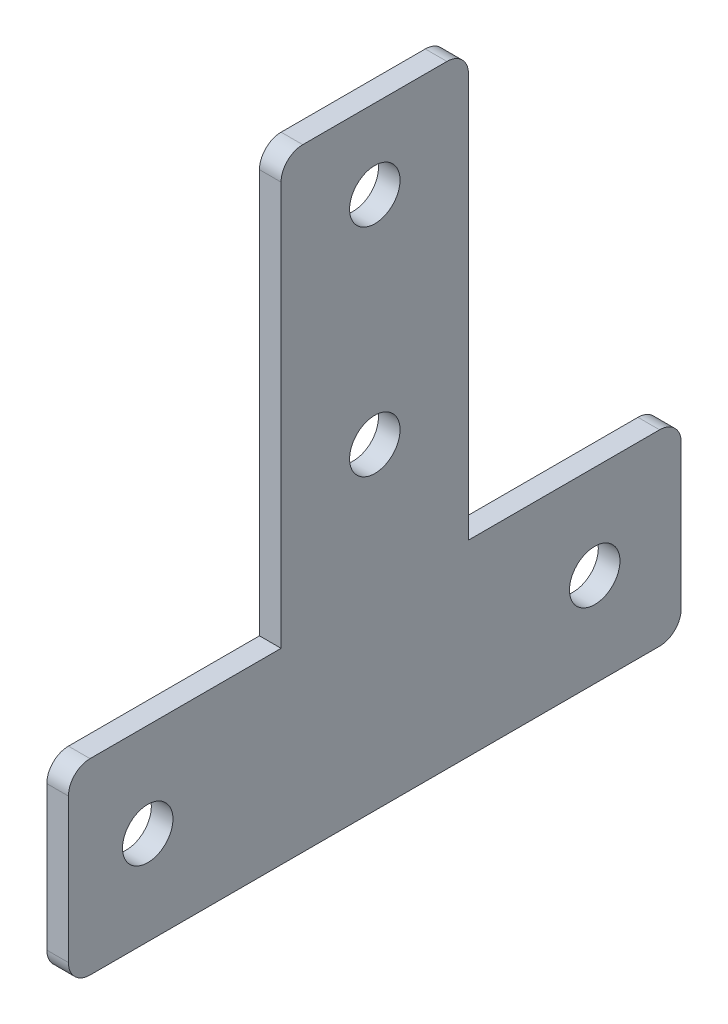
ISO-10303-21;
HEADER;
FILE_DESCRIPTION(('STEP AP214'),'2;1');
FILE_NAME('part.step','',(''),(''),'','','');
FILE_SCHEMA(('AUTOMOTIVE_DESIGN { 1 0 10303 214 1 1 1 1 }'));
ENDSEC;
DATA;
#1=APPLICATION_CONTEXT('core data for automotive mechanical design processes');
#2=APPLICATION_PROTOCOL_DEFINITION('international standard','automotive_design',2000,#1);
#3=PRODUCT_CONTEXT('',#1,'mechanical');
#4=PRODUCT('Part','Part','',(#3));
#5=PRODUCT_RELATED_PRODUCT_CATEGORY('part','',(#4));
#6=PRODUCT_DEFINITION_FORMATION('','',#4);
#7=PRODUCT_DEFINITION_CONTEXT('part definition',#1,'design');
#8=PRODUCT_DEFINITION('design','',#6,#7);
#9=PRODUCT_DEFINITION_SHAPE('','',#8);
#10=(LENGTH_UNIT() NAMED_UNIT(*) SI_UNIT(.MILLI.,.METRE.));
#11=(NAMED_UNIT(*) PLANE_ANGLE_UNIT() SI_UNIT($,.RADIAN.));
#12=(NAMED_UNIT(*) SI_UNIT($,.STERADIAN.) SOLID_ANGLE_UNIT());
#13=UNCERTAINTY_MEASURE_WITH_UNIT(LENGTH_MEASURE(1.E-05),#10,'distance_accuracy_value','');
#14=(GEOMETRIC_REPRESENTATION_CONTEXT(3) GLOBAL_UNCERTAINTY_ASSIGNED_CONTEXT((#13)) GLOBAL_UNIT_ASSIGNED_CONTEXT((#10,
#11,#12)) REPRESENTATION_CONTEXT('',''));
#15=CARTESIAN_POINT('',(0.,0.,0.));
#16=DIRECTION('',(0.,0.,1.));
#17=DIRECTION('',(1.,0.,0.));
#18=AXIS2_PLACEMENT_3D('',#15,#16,#17);
#19=CARTESIAN_POINT('',(3.,85.,0.));
#20=DIRECTION('',(0.,-1.,0.));
#21=DIRECTION('',(0.,0.,-1.));
#22=AXIS2_PLACEMENT_3D('',#19,#20,#21);
#23=PLANE('',#22);
#24=DIRECTION('',(0.,0.,1.));
#25=VECTOR('',#24,1.);
#26=CARTESIAN_POINT('',(3.,85.,0.));
#27=LINE('',#26,#25);
#28=CARTESIAN_POINT('',(3.,85.,-52.5));
#29=VERTEX_POINT('',#28);
#30=CARTESIAN_POINT('',(3.,85.,-32.5));
#31=VERTEX_POINT('',#30);
#32=EDGE_CURVE('E188',#29,#31,#27,.T.);
#33=ORIENTED_EDGE('',*,*,#32,.F.);
#34=DIRECTION('',(-1.,0.,0.));
#35=VECTOR('',#34,1.);
#36=CARTESIAN_POINT('',(0.,85.,-52.5));
#37=LINE('',#36,#35);
#38=CARTESIAN_POINT('',(0.,85.,-52.5));
#39=VERTEX_POINT('',#38);
#40=EDGE_CURVE('E208',#29,#39,#37,.T.);
#41=ORIENTED_EDGE('',*,*,#40,.T.);
#42=DIRECTION('',(0.,0.,1.));
#43=VECTOR('',#42,1.);
#44=CARTESIAN_POINT('',(0.,85.,0.));
#45=LINE('',#44,#43);
#46=CARTESIAN_POINT('',(0.,85.,-32.5));
#47=VERTEX_POINT('',#46);
#48=EDGE_CURVE('E199',#39,#47,#45,.T.);
#49=ORIENTED_EDGE('',*,*,#48,.T.);
#50=DIRECTION('',(-1.,0.,0.));
#51=VECTOR('',#50,1.);
#52=CARTESIAN_POINT('',(3.,85.,-32.5));
#53=LINE('',#52,#51);
#54=EDGE_CURVE('E197',#47,#31,#53,.F.);
#55=ORIENTED_EDGE('',*,*,#54,.T.);
#56=EDGE_LOOP('',(#33,#41,#49,#55));
#57=FACE_BOUND('',#56,.T.);
#58=ADVANCED_FACE('F39',(#57),#23,.F.);
#59=CARTESIAN_POINT('',(3.,0.,0.));
#60=DIRECTION('',(-1.,0.,0.));
#61=DIRECTION('',(0.,0.,1.));
#62=AXIS2_PLACEMENT_3D('',#59,#60,#61);
#63=PLANE('',#62);
#64=CARTESIAN_POINT('',(3.,74.,-42.5));
#65=DIRECTION('',(1.,0.,0.));
#66=DIRECTION('',(0.,0.,-1.));
#67=AXIS2_PLACEMENT_3D('',#64,#65,#66);
#68=CIRCLE('',#67,3.5);
#69=CARTESIAN_POINT('',(3.,74.,-46.));
#70=VERTEX_POINT('',#69);
#71=EDGE_CURVE('E521',#70,#70,#68,.T.);
#72=ORIENTED_EDGE('',*,*,#71,.F.);
#73=EDGE_LOOP('',(#72));
#74=FACE_BOUND('',#73,.T.);
#75=CARTESIAN_POINT('',(3.,44.,-42.5));
#76=DIRECTION('',(1.,0.,0.));
#77=DIRECTION('',(0.,0.,-1.));
#78=AXIS2_PLACEMENT_3D('',#75,#76,#77);
#79=CIRCLE('',#78,3.5);
#80=CARTESIAN_POINT('',(3.,44.,-46.));
#81=VERTEX_POINT('',#80);
#82=EDGE_CURVE('E517',#81,#81,#79,.T.);
#83=ORIENTED_EDGE('',*,*,#82,.F.);
#84=EDGE_LOOP('',(#83));
#85=FACE_BOUND('',#84,.T.);
#86=CARTESIAN_POINT('',(3.,13.,-11.));
#87=DIRECTION('',(1.,0.,0.));
#88=DIRECTION('',(0.,0.,-1.));
#89=AXIS2_PLACEMENT_3D('',#86,#87,#88);
#90=CIRCLE('',#89,3.5);
#91=CARTESIAN_POINT('',(3.,13.,-14.5));
#92=VERTEX_POINT('',#91);
#93=EDGE_CURVE('E511',#92,#92,#90,.T.);
#94=ORIENTED_EDGE('',*,*,#93,.F.);
#95=EDGE_LOOP('',(#94));
#96=FACE_BOUND('',#95,.T.);
#97=CARTESIAN_POINT('',(3.,13.,-73.));
#98=DIRECTION('',(1.,0.,0.));
#99=DIRECTION('',(0.,0.,-1.));
#100=AXIS2_PLACEMENT_3D('',#97,#98,#99);
#101=CIRCLE('',#100,3.5);
#102=CARTESIAN_POINT('',(3.,13.,-76.5));
#103=VERTEX_POINT('',#102);
#104=EDGE_CURVE('E507',#103,#103,#101,.T.);
#105=ORIENTED_EDGE('',*,*,#104,.F.);
#106=EDGE_LOOP('',(#105));
#107=FACE_BOUND('',#106,.T.);
#108=DIRECTION('',(0.,-1.,0.));
#109=VECTOR('',#108,1.);
#110=CARTESIAN_POINT('',(3.,85.,-55.5));
#111=LINE('',#110,#109);
#112=CARTESIAN_POINT('',(3.,82.,-55.5));
#113=VERTEX_POINT('',#112);
#114=CARTESIAN_POINT('',(3.,26.,-55.5));
#115=VERTEX_POINT('',#114);
#116=EDGE_CURVE('E141',#113,#115,#111,.T.);
#117=ORIENTED_EDGE('',*,*,#116,.F.);
#118=CARTESIAN_POINT('',(3.,82.,-52.5));
#119=DIRECTION('',(-1.,0.,0.));
#120=DIRECTION('',(0.,0.,1.));
#121=AXIS2_PLACEMENT_3D('',#118,#119,#120);
#122=CIRCLE('',#121,3.);
#123=EDGE_CURVE('E232',#113,#29,#122,.F.);
#124=ORIENTED_EDGE('',*,*,#123,.T.);
#125=ORIENTED_EDGE('',*,*,#32,.T.);
#126=CARTESIAN_POINT('',(3.,82.,-32.5));
#127=DIRECTION('',(-1.,0.,0.));
#128=DIRECTION('',(0.,0.,1.));
#129=AXIS2_PLACEMENT_3D('',#126,#127,#128);
#130=CIRCLE('',#129,3.);
#131=CARTESIAN_POINT('',(3.,82.,-29.5));
#132=VERTEX_POINT('',#131);
#133=EDGE_CURVE('E230',#31,#132,#130,.F.);
#134=ORIENTED_EDGE('',*,*,#133,.T.);
#135=DIRECTION('',(0.,1.,0.));
#136=VECTOR('',#135,1.);
#137=CARTESIAN_POINT('',(3.,85.,-29.5));
#138=LINE('',#137,#136);
#139=CARTESIAN_POINT('',(3.,26.,-29.5));
#140=VERTEX_POINT('',#139);
#141=EDGE_CURVE('E175',#140,#132,#138,.T.);
#142=ORIENTED_EDGE('',*,*,#141,.F.);
#143=DIRECTION('',(0.,0.,-1.));
#144=VECTOR('',#143,1.);
#145=CARTESIAN_POINT('',(3.,26.,-29.5));
#146=LINE('',#145,#144);
#147=CARTESIAN_POINT('',(3.,26.,-3.));
#148=VERTEX_POINT('',#147);
#149=EDGE_CURVE('E173',#148,#140,#146,.T.);
#150=ORIENTED_EDGE('',*,*,#149,.F.);
#151=CARTESIAN_POINT('',(3.,23.,-3.));
#152=DIRECTION('',(-1.,0.,0.));
#153=DIRECTION('',(0.,0.,1.));
#154=AXIS2_PLACEMENT_3D('',#151,#152,#153);
#155=CIRCLE('',#154,3.);
#156=CARTESIAN_POINT('',(3.,23.,0.));
#157=VERTEX_POINT('',#156);
#158=EDGE_CURVE('E227',#148,#157,#155,.F.);
#159=ORIENTED_EDGE('',*,*,#158,.T.);
#160=DIRECTION('',(0.,-1.,0.));
#161=VECTOR('',#160,1.);
#162=CARTESIAN_POINT('',(3.,0.,0.));
#163=LINE('',#162,#161);
#164=CARTESIAN_POINT('',(3.,3.,0.));
#165=VERTEX_POINT('',#164);
#166=EDGE_CURVE('E192',#157,#165,#163,.T.);
#167=ORIENTED_EDGE('',*,*,#166,.T.);
#168=CARTESIAN_POINT('',(3.,3.,-3.));
#169=DIRECTION('',(-1.,0.,0.));
#170=DIRECTION('',(0.,0.,1.));
#171=AXIS2_PLACEMENT_3D('',#168,#169,#170);
#172=CIRCLE('',#171,3.);
#173=CARTESIAN_POINT('',(3.,0.,-3.));
#174=VERTEX_POINT('',#173);
#175=EDGE_CURVE('E224',#165,#174,#172,.F.);
#176=ORIENTED_EDGE('',*,*,#175,.T.);
#177=DIRECTION('',(0.,0.,-1.));
#178=VECTOR('',#177,1.);
#179=CARTESIAN_POINT('',(3.,0.,0.));
#180=LINE('',#179,#178);
#181=CARTESIAN_POINT('',(3.,0.,-82.));
#182=VERTEX_POINT('',#181);
#183=EDGE_CURVE('E195',#174,#182,#180,.T.);
#184=ORIENTED_EDGE('',*,*,#183,.T.);
#185=CARTESIAN_POINT('',(3.,3.,-82.));
#186=DIRECTION('',(-1.,0.,0.));
#187=DIRECTION('',(0.,0.,1.));
#188=AXIS2_PLACEMENT_3D('',#185,#186,#187);
#189=CIRCLE('',#188,3.);
#190=CARTESIAN_POINT('',(3.,3.,-85.));
#191=VERTEX_POINT('',#190);
#192=EDGE_CURVE('E61',#182,#191,#189,.F.);
#193=ORIENTED_EDGE('',*,*,#192,.T.);
#194=DIRECTION('',(0.,1.,0.));
#195=VECTOR('',#194,1.);
#196=CARTESIAN_POINT('',(3.,0.,-85.));
#197=LINE('',#196,#195);
#198=CARTESIAN_POINT('',(3.,23.,-85.));
#199=VERTEX_POINT('',#198);
#200=EDGE_CURVE('E186',#191,#199,#197,.T.);
#201=ORIENTED_EDGE('',*,*,#200,.T.);
#202=CARTESIAN_POINT('',(3.,23.,-82.));
#203=DIRECTION('',(-1.,0.,0.));
#204=DIRECTION('',(0.,0.,1.));
#205=AXIS2_PLACEMENT_3D('',#202,#203,#204);
#206=CIRCLE('',#205,3.);
#207=CARTESIAN_POINT('',(3.,26.,-82.));
#208=VERTEX_POINT('',#207);
#209=EDGE_CURVE('E164',#199,#208,#206,.F.);
#210=ORIENTED_EDGE('',*,*,#209,.T.);
#211=DIRECTION('',(0.,0.,-1.));
#212=VECTOR('',#211,1.);
#213=CARTESIAN_POINT('',(3.,26.,-55.5));
#214=LINE('',#213,#212);
#215=EDGE_CURVE('E151',#115,#208,#214,.T.);
#216=ORIENTED_EDGE('',*,*,#215,.F.);
#217=EDGE_LOOP('',(#117,#124,#125,#134,#142,#150,#159,#167,#176,#184,#193,#201,#210,#216));
#218=FACE_BOUND('',#217,.T.);
#219=ADVANCED_FACE('F162',(#74,#85,#96,#107,#218),#63,.F.);
#220=CARTESIAN_POINT('',(0.,0.,0.));
#221=DIRECTION('',(-1.,0.,0.));
#222=DIRECTION('',(0.,0.,1.));
#223=AXIS2_PLACEMENT_3D('',#220,#221,#222);
#224=PLANE('',#223);
#225=CARTESIAN_POINT('',(0.,74.,-42.5));
#226=DIRECTION('',(1.,0.,0.));
#227=DIRECTION('',(0.,0.,-1.));
#228=AXIS2_PLACEMENT_3D('',#225,#226,#227);
#229=CIRCLE('',#228,3.5);
#230=CARTESIAN_POINT('',(0.,74.,-46.));
#231=VERTEX_POINT('',#230);
#232=EDGE_CURVE('E496',#231,#231,#229,.T.);
#233=ORIENTED_EDGE('',*,*,#232,.T.);
#234=EDGE_LOOP('',(#233));
#235=FACE_BOUND('',#234,.T.);
#236=CARTESIAN_POINT('',(0.,44.,-42.5));
#237=DIRECTION('',(1.,0.,0.));
#238=DIRECTION('',(0.,0.,-1.));
#239=AXIS2_PLACEMENT_3D('',#236,#237,#238);
#240=CIRCLE('',#239,3.5);
#241=CARTESIAN_POINT('',(0.,44.,-46.));
#242=VERTEX_POINT('',#241);
#243=EDGE_CURVE('E500',#242,#242,#240,.T.);
#244=ORIENTED_EDGE('',*,*,#243,.T.);
#245=EDGE_LOOP('',(#244));
#246=FACE_BOUND('',#245,.T.);
#247=CARTESIAN_POINT('',(0.,13.,-11.));
#248=DIRECTION('',(1.,0.,0.));
#249=DIRECTION('',(0.,0.,-1.));
#250=AXIS2_PLACEMENT_3D('',#247,#248,#249);
#251=CIRCLE('',#250,3.5);
#252=CARTESIAN_POINT('',(0.,13.,-14.5));
#253=VERTEX_POINT('',#252);
#254=EDGE_CURVE('E504',#253,#253,#251,.T.);
#255=ORIENTED_EDGE('',*,*,#254,.T.);
#256=EDGE_LOOP('',(#255));
#257=FACE_BOUND('',#256,.T.);
#258=CARTESIAN_POINT('',(0.,13.,-73.));
#259=DIRECTION('',(1.,0.,0.));
#260=DIRECTION('',(0.,0.,-1.));
#261=AXIS2_PLACEMENT_3D('',#258,#259,#260);
#262=CIRCLE('',#261,3.5);
#263=CARTESIAN_POINT('',(0.,13.,-76.5));
#264=VERTEX_POINT('',#263);
#265=EDGE_CURVE('E169',#264,#264,#262,.T.);
#266=ORIENTED_EDGE('',*,*,#265,.T.);
#267=EDGE_LOOP('',(#266));
#268=FACE_BOUND('',#267,.T.);
#269=ORIENTED_EDGE('',*,*,#48,.F.);
#270=CARTESIAN_POINT('',(0.,82.,-52.5));
#271=DIRECTION('',(-1.,0.,0.));
#272=DIRECTION('',(0.,0.,1.));
#273=AXIS2_PLACEMENT_3D('',#270,#271,#272);
#274=CIRCLE('',#273,3.);
#275=CARTESIAN_POINT('',(0.,82.,-55.5));
#276=VERTEX_POINT('',#275);
#277=EDGE_CURVE('E221',#39,#276,#274,.T.);
#278=ORIENTED_EDGE('',*,*,#277,.T.);
#279=DIRECTION('',(0.,-1.,0.));
#280=VECTOR('',#279,1.);
#281=CARTESIAN_POINT('',(0.,85.,-55.5));
#282=LINE('',#281,#280);
#283=CARTESIAN_POINT('',(0.,26.,-55.5));
#284=VERTEX_POINT('',#283);
#285=EDGE_CURVE('E165',#276,#284,#282,.T.);
#286=ORIENTED_EDGE('',*,*,#285,.T.);
#287=DIRECTION('',(0.,0.,-1.));
#288=VECTOR('',#287,1.);
#289=CARTESIAN_POINT('',(0.,26.,-55.5));
#290=LINE('',#289,#288);
#291=CARTESIAN_POINT('',(0.,26.,-82.));
#292=VERTEX_POINT('',#291);
#293=EDGE_CURVE('E159',#284,#292,#290,.T.);
#294=ORIENTED_EDGE('',*,*,#293,.T.);
#295=CARTESIAN_POINT('',(0.,23.,-82.));
#296=DIRECTION('',(-1.,0.,0.));
#297=DIRECTION('',(0.,0.,1.));
#298=AXIS2_PLACEMENT_3D('',#295,#296,#297);
#299=CIRCLE('',#298,3.);
#300=CARTESIAN_POINT('',(0.,23.,-85.));
#301=VERTEX_POINT('',#300);
#302=EDGE_CURVE('E217',#292,#301,#299,.T.);
#303=ORIENTED_EDGE('',*,*,#302,.T.);
#304=DIRECTION('',(0.,1.,0.));
#305=VECTOR('',#304,1.);
#306=CARTESIAN_POINT('',(0.,0.,-85.));
#307=LINE('',#306,#305);
#308=CARTESIAN_POINT('',(0.,3.,-85.));
#309=VERTEX_POINT('',#308);
#310=EDGE_CURVE('E185',#309,#301,#307,.T.);
#311=ORIENTED_EDGE('',*,*,#310,.F.);
#312=CARTESIAN_POINT('',(0.,3.,-82.));
#313=DIRECTION('',(-1.,0.,0.));
#314=DIRECTION('',(0.,0.,1.));
#315=AXIS2_PLACEMENT_3D('',#312,#313,#314);
#316=CIRCLE('',#315,3.);
#317=CARTESIAN_POINT('',(0.,0.,-82.));
#318=VERTEX_POINT('',#317);
#319=EDGE_CURVE('E213',#309,#318,#316,.T.);
#320=ORIENTED_EDGE('',*,*,#319,.T.);
#321=DIRECTION('',(0.,0.,-1.));
#322=VECTOR('',#321,1.);
#323=CARTESIAN_POINT('',(0.,0.,0.));
#324=LINE('',#323,#322);
#325=CARTESIAN_POINT('',(0.,0.,-3.));
#326=VERTEX_POINT('',#325);
#327=EDGE_CURVE('E189',#326,#318,#324,.T.);
#328=ORIENTED_EDGE('',*,*,#327,.F.);
#329=CARTESIAN_POINT('',(0.,3.,-3.));
#330=DIRECTION('',(-1.,0.,0.));
#331=DIRECTION('',(0.,0.,1.));
#332=AXIS2_PLACEMENT_3D('',#329,#330,#331);
#333=CIRCLE('',#332,3.);
#334=CARTESIAN_POINT('',(0.,3.,0.));
#335=VERTEX_POINT('',#334);
#336=EDGE_CURVE('E211',#326,#335,#333,.T.);
#337=ORIENTED_EDGE('',*,*,#336,.T.);
#338=DIRECTION('',(0.,-1.,0.));
#339=VECTOR('',#338,1.);
#340=CARTESIAN_POINT('',(0.,0.,0.));
#341=LINE('',#340,#339);
#342=CARTESIAN_POINT('',(0.,23.,0.));
#343=VERTEX_POINT('',#342);
#344=EDGE_CURVE('E202',#343,#335,#341,.T.);
#345=ORIENTED_EDGE('',*,*,#344,.F.);
#346=CARTESIAN_POINT('',(0.,23.,-3.));
#347=DIRECTION('',(-1.,0.,0.));
#348=DIRECTION('',(0.,0.,1.));
#349=AXIS2_PLACEMENT_3D('',#346,#347,#348);
#350=CIRCLE('',#349,3.);
#351=CARTESIAN_POINT('',(0.,26.,-3.));
#352=VERTEX_POINT('',#351);
#353=EDGE_CURVE('E215',#343,#352,#350,.T.);
#354=ORIENTED_EDGE('',*,*,#353,.T.);
#355=DIRECTION('',(0.,0.,-1.));
#356=VECTOR('',#355,1.);
#357=CARTESIAN_POINT('',(0.,26.,-29.5));
#358=LINE('',#357,#356);
#359=CARTESIAN_POINT('',(0.,26.,-29.5));
#360=VERTEX_POINT('',#359);
#361=EDGE_CURVE('E160',#352,#360,#358,.T.);
#362=ORIENTED_EDGE('',*,*,#361,.T.);
#363=DIRECTION('',(0.,1.,0.));
#364=VECTOR('',#363,1.);
#365=CARTESIAN_POINT('',(0.,85.,-29.5));
#366=LINE('',#365,#364);
#367=CARTESIAN_POINT('',(0.,82.,-29.5));
#368=VERTEX_POINT('',#367);
#369=EDGE_CURVE('E176',#360,#368,#366,.T.);
#370=ORIENTED_EDGE('',*,*,#369,.T.);
#371=CARTESIAN_POINT('',(0.,82.,-32.5));
#372=DIRECTION('',(-1.,0.,0.));
#373=DIRECTION('',(0.,0.,1.));
#374=AXIS2_PLACEMENT_3D('',#371,#372,#373);
#375=CIRCLE('',#374,3.);
#376=EDGE_CURVE('E219',#368,#47,#375,.T.);
#377=ORIENTED_EDGE('',*,*,#376,.T.);
#378=EDGE_LOOP('',(#269,#278,#286,#294,#303,#311,#320,#328,#337,#345,#354,#362,#370,#377));
#379=FACE_BOUND('',#378,.T.);
#380=ADVANCED_FACE('F260',(#235,#246,#257,#268,#379),#224,.T.);
#381=CARTESIAN_POINT('',(3.,0.,-85.));
#382=DIRECTION('',(0.,0.,1.));
#383=DIRECTION('',(0.,-1.,0.));
#384=AXIS2_PLACEMENT_3D('',#381,#382,#383);
#385=PLANE('',#384);
#386=ORIENTED_EDGE('',*,*,#310,.T.);
#387=DIRECTION('',(-1.,0.,0.));
#388=VECTOR('',#387,1.);
#389=CARTESIAN_POINT('',(3.,23.,-85.));
#390=LINE('',#389,#388);
#391=EDGE_CURVE('E54',#301,#199,#390,.F.);
#392=ORIENTED_EDGE('',*,*,#391,.T.);
#393=ORIENTED_EDGE('',*,*,#200,.F.);
#394=DIRECTION('',(-1.,0.,0.));
#395=VECTOR('',#394,1.);
#396=CARTESIAN_POINT('',(3.,3.,-85.));
#397=LINE('',#396,#395);
#398=EDGE_CURVE('E239',#191,#309,#397,.T.);
#399=ORIENTED_EDGE('',*,*,#398,.T.);
#400=EDGE_LOOP('',(#386,#392,#393,#399));
#401=FACE_BOUND('',#400,.T.);
#402=ADVANCED_FACE('F266',(#401),#385,.F.);
#403=CARTESIAN_POINT('',(3.,0.,0.));
#404=DIRECTION('',(0.,0.,-1.));
#405=DIRECTION('',(-1.,0.,0.));
#406=AXIS2_PLACEMENT_3D('',#403,#404,#405);
#407=PLANE('',#406);
#408=ORIENTED_EDGE('',*,*,#166,.F.);
#409=DIRECTION('',(-1.,0.,0.));
#410=VECTOR('',#409,1.);
#411=CARTESIAN_POINT('',(0.,23.,0.));
#412=LINE('',#411,#410);
#413=EDGE_CURVE('E245',#157,#343,#412,.T.);
#414=ORIENTED_EDGE('',*,*,#413,.T.);
#415=ORIENTED_EDGE('',*,*,#344,.T.);
#416=DIRECTION('',(-1.,0.,0.));
#417=VECTOR('',#416,1.);
#418=CARTESIAN_POINT('',(3.,3.,0.));
#419=LINE('',#418,#417);
#420=EDGE_CURVE('E243',#335,#165,#419,.F.);
#421=ORIENTED_EDGE('',*,*,#420,.T.);
#422=EDGE_LOOP('',(#408,#414,#415,#421));
#423=FACE_BOUND('',#422,.T.);
#424=ADVANCED_FACE('F295',(#423),#407,.F.);
#425=CARTESIAN_POINT('',(3.,0.,0.));
#426=DIRECTION('',(0.,1.,0.));
#427=DIRECTION('',(0.,0.,1.));
#428=AXIS2_PLACEMENT_3D('',#425,#426,#427);
#429=PLANE('',#428);
#430=ORIENTED_EDGE('',*,*,#327,.T.);
#431=DIRECTION('',(-1.,0.,0.));
#432=VECTOR('',#431,1.);
#433=CARTESIAN_POINT('',(3.,0.,-82.));
#434=LINE('',#433,#432);
#435=EDGE_CURVE('E11',#318,#182,#434,.F.);
#436=ORIENTED_EDGE('',*,*,#435,.T.);
#437=ORIENTED_EDGE('',*,*,#183,.F.);
#438=DIRECTION('',(-1.,0.,0.));
#439=VECTOR('',#438,1.);
#440=CARTESIAN_POINT('',(3.,0.,-3.));
#441=LINE('',#440,#439);
#442=EDGE_CURVE('E47',#174,#326,#441,.T.);
#443=ORIENTED_EDGE('',*,*,#442,.T.);
#444=EDGE_LOOP('',(#430,#436,#437,#443));
#445=FACE_BOUND('',#444,.T.);
#446=ADVANCED_FACE('F254',(#445),#429,.F.);
#447=CARTESIAN_POINT('',(3.,26.,-29.5));
#448=DIRECTION('',(0.,1.,0.));
#449=DIRECTION('',(0.,0.,1.));
#450=AXIS2_PLACEMENT_3D('',#447,#448,#449);
#451=PLANE('',#450);
#452=ORIENTED_EDGE('',*,*,#361,.F.);
#453=DIRECTION('',(-1.,0.,0.));
#454=VECTOR('',#453,1.);
#455=CARTESIAN_POINT('',(3.,26.,-3.));
#456=LINE('',#455,#454);
#457=EDGE_CURVE('E248',#352,#148,#456,.F.);
#458=ORIENTED_EDGE('',*,*,#457,.T.);
#459=ORIENTED_EDGE('',*,*,#149,.T.);
#460=DIRECTION('',(-1.,0.,0.));
#461=VECTOR('',#460,1.);
#462=CARTESIAN_POINT('',(3.,26.,-29.5));
#463=LINE('',#462,#461);
#464=EDGE_CURVE('E179',#140,#360,#463,.T.);
#465=ORIENTED_EDGE('',*,*,#464,.T.);
#466=EDGE_LOOP('',(#452,#458,#459,#465));
#467=FACE_BOUND('',#466,.T.);
#468=ADVANCED_FACE('F287',(#467),#451,.T.);
#469=CARTESIAN_POINT('',(3.,85.,-29.5));
#470=DIRECTION('',(0.,0.,1.));
#471=DIRECTION('',(0.,-1.,0.));
#472=AXIS2_PLACEMENT_3D('',#469,#470,#471);
#473=PLANE('',#472);
#474=ORIENTED_EDGE('',*,*,#141,.T.);
#475=DIRECTION('',(-1.,0.,0.));
#476=VECTOR('',#475,1.);
#477=CARTESIAN_POINT('',(0.,82.,-29.5));
#478=LINE('',#477,#476);
#479=EDGE_CURVE('E234',#132,#368,#478,.T.);
#480=ORIENTED_EDGE('',*,*,#479,.T.);
#481=ORIENTED_EDGE('',*,*,#369,.F.);
#482=ORIENTED_EDGE('',*,*,#464,.F.);
#483=EDGE_LOOP('',(#474,#480,#481,#482));
#484=FACE_BOUND('',#483,.T.);
#485=ADVANCED_FACE('F283',(#484),#473,.T.);
#486=CARTESIAN_POINT('',(3.,26.,-55.5));
#487=DIRECTION('',(0.,1.,0.));
#488=DIRECTION('',(0.,0.,1.));
#489=AXIS2_PLACEMENT_3D('',#486,#487,#488);
#490=PLANE('',#489);
#491=ORIENTED_EDGE('',*,*,#215,.T.);
#492=DIRECTION('',(-1.,0.,0.));
#493=VECTOR('',#492,1.);
#494=CARTESIAN_POINT('',(0.,26.,-82.));
#495=LINE('',#494,#493);
#496=EDGE_CURVE('E237',#208,#292,#495,.T.);
#497=ORIENTED_EDGE('',*,*,#496,.T.);
#498=ORIENTED_EDGE('',*,*,#293,.F.);
#499=DIRECTION('',(-1.,0.,0.));
#500=VECTOR('',#499,1.);
#501=CARTESIAN_POINT('',(3.,26.,-55.5));
#502=LINE('',#501,#500);
#503=EDGE_CURVE('E145',#115,#284,#502,.T.);
#504=ORIENTED_EDGE('',*,*,#503,.F.);
#505=EDGE_LOOP('',(#491,#497,#498,#504));
#506=FACE_BOUND('',#505,.T.);
#507=ADVANCED_FACE('F155',(#506),#490,.T.);
#508=CARTESIAN_POINT('',(3.,85.,-55.5));
#509=DIRECTION('',(0.,0.,-1.));
#510=DIRECTION('',(0.,1.,0.));
#511=AXIS2_PLACEMENT_3D('',#508,#509,#510);
#512=PLANE('',#511);
#513=ORIENTED_EDGE('',*,*,#285,.F.);
#514=DIRECTION('',(-1.,0.,0.));
#515=VECTOR('',#514,1.);
#516=CARTESIAN_POINT('',(3.,82.,-55.5));
#517=LINE('',#516,#515);
#518=EDGE_CURVE('E148',#276,#113,#517,.F.);
#519=ORIENTED_EDGE('',*,*,#518,.T.);
#520=ORIENTED_EDGE('',*,*,#116,.T.);
#521=ORIENTED_EDGE('',*,*,#503,.T.);
#522=EDGE_LOOP('',(#513,#519,#520,#521));
#523=FACE_BOUND('',#522,.T.);
#524=ADVANCED_FACE('F144',(#523),#512,.T.);
#525=CARTESIAN_POINT('',(3.,13.,-73.));
#526=DIRECTION('',(1.,0.,0.));
#527=DIRECTION('',(0.,0.,-1.));
#528=AXIS2_PLACEMENT_3D('',#525,#526,#527);
#529=CYLINDRICAL_SURFACE('',#528,3.5);
#530=ORIENTED_EDGE('',*,*,#265,.F.);
#531=EDGE_LOOP('',(#530));
#532=FACE_BOUND('',#531,.T.);
#533=ORIENTED_EDGE('',*,*,#104,.T.);
#534=EDGE_LOOP('',(#533));
#535=FACE_BOUND('',#534,.T.);
#536=ADVANCED_FACE('F387',(#532,#535),#529,.F.);
#537=CARTESIAN_POINT('',(3.,13.,-11.));
#538=DIRECTION('',(1.,0.,0.));
#539=DIRECTION('',(0.,0.,-1.));
#540=AXIS2_PLACEMENT_3D('',#537,#538,#539);
#541=CYLINDRICAL_SURFACE('',#540,3.5);
#542=ORIENTED_EDGE('',*,*,#254,.F.);
#543=EDGE_LOOP('',(#542));
#544=FACE_BOUND('',#543,.T.);
#545=ORIENTED_EDGE('',*,*,#93,.T.);
#546=EDGE_LOOP('',(#545));
#547=FACE_BOUND('',#546,.T.);
#548=ADVANCED_FACE('F377',(#544,#547),#541,.F.);
#549=CARTESIAN_POINT('',(3.,44.,-42.5));
#550=DIRECTION('',(1.,0.,0.));
#551=DIRECTION('',(0.,0.,-1.));
#552=AXIS2_PLACEMENT_3D('',#549,#550,#551);
#553=CYLINDRICAL_SURFACE('',#552,3.5);
#554=ORIENTED_EDGE('',*,*,#243,.F.);
#555=EDGE_LOOP('',(#554));
#556=FACE_BOUND('',#555,.T.);
#557=ORIENTED_EDGE('',*,*,#82,.T.);
#558=EDGE_LOOP('',(#557));
#559=FACE_BOUND('',#558,.T.);
#560=ADVANCED_FACE('F367',(#556,#559),#553,.F.);
#561=CARTESIAN_POINT('',(3.,74.,-42.5));
#562=DIRECTION('',(1.,0.,0.));
#563=DIRECTION('',(0.,0.,-1.));
#564=AXIS2_PLACEMENT_3D('',#561,#562,#563);
#565=CYLINDRICAL_SURFACE('',#564,3.5);
#566=ORIENTED_EDGE('',*,*,#232,.F.);
#567=EDGE_LOOP('',(#566));
#568=FACE_BOUND('',#567,.T.);
#569=ORIENTED_EDGE('',*,*,#71,.T.);
#570=EDGE_LOOP('',(#569));
#571=FACE_BOUND('',#570,.T.);
#572=ADVANCED_FACE('F315',(#568,#571),#565,.F.);
#573=CARTESIAN_POINT('',(3.,82.,-52.5));
#574=DIRECTION('',(1.,0.,0.));
#575=DIRECTION('',(0.,0.,-1.));
#576=AXIS2_PLACEMENT_3D('',#573,#574,#575);
#577=CYLINDRICAL_SURFACE('',#576,3.);
#578=ORIENTED_EDGE('',*,*,#123,.F.);
#579=ORIENTED_EDGE('',*,*,#518,.F.);
#580=ORIENTED_EDGE('',*,*,#277,.F.);
#581=ORIENTED_EDGE('',*,*,#40,.F.);
#582=EDGE_LOOP('',(#578,#579,#580,#581));
#583=FACE_BOUND('',#582,.T.);
#584=ADVANCED_FACE('F270',(#583),#577,.T.);
#585=CARTESIAN_POINT('',(3.,82.,-32.5));
#586=DIRECTION('',(1.,0.,0.));
#587=DIRECTION('',(0.,0.,-1.));
#588=AXIS2_PLACEMENT_3D('',#585,#586,#587);
#589=CYLINDRICAL_SURFACE('',#588,3.);
#590=ORIENTED_EDGE('',*,*,#133,.F.);
#591=ORIENTED_EDGE('',*,*,#54,.F.);
#592=ORIENTED_EDGE('',*,*,#376,.F.);
#593=ORIENTED_EDGE('',*,*,#479,.F.);
#594=EDGE_LOOP('',(#590,#591,#592,#593));
#595=FACE_BOUND('',#594,.T.);
#596=ADVANCED_FACE('F277',(#595),#589,.T.);
#597=CARTESIAN_POINT('',(3.,23.,-82.));
#598=DIRECTION('',(1.,0.,0.));
#599=DIRECTION('',(0.,0.,-1.));
#600=AXIS2_PLACEMENT_3D('',#597,#598,#599);
#601=CYLINDRICAL_SURFACE('',#600,3.);
#602=ORIENTED_EDGE('',*,*,#209,.F.);
#603=ORIENTED_EDGE('',*,*,#391,.F.);
#604=ORIENTED_EDGE('',*,*,#302,.F.);
#605=ORIENTED_EDGE('',*,*,#496,.F.);
#606=EDGE_LOOP('',(#602,#603,#604,#605));
#607=FACE_BOUND('',#606,.T.);
#608=ADVANCED_FACE('F268',(#607),#601,.T.);
#609=CARTESIAN_POINT('',(3.,23.,-3.));
#610=DIRECTION('',(1.,0.,0.));
#611=DIRECTION('',(0.,0.,-1.));
#612=AXIS2_PLACEMENT_3D('',#609,#610,#611);
#613=CYLINDRICAL_SURFACE('',#612,3.);
#614=ORIENTED_EDGE('',*,*,#158,.F.);
#615=ORIENTED_EDGE('',*,*,#457,.F.);
#616=ORIENTED_EDGE('',*,*,#353,.F.);
#617=ORIENTED_EDGE('',*,*,#413,.F.);
#618=EDGE_LOOP('',(#614,#615,#616,#617));
#619=FACE_BOUND('',#618,.T.);
#620=ADVANCED_FACE('F293',(#619),#613,.T.);
#621=CARTESIAN_POINT('',(3.,3.,-82.));
#622=DIRECTION('',(-1.,0.,0.));
#623=DIRECTION('',(0.,0.,1.));
#624=AXIS2_PLACEMENT_3D('',#621,#622,#623);
#625=CYLINDRICAL_SURFACE('',#624,3.);
#626=ORIENTED_EDGE('',*,*,#192,.F.);
#627=ORIENTED_EDGE('',*,*,#435,.F.);
#628=ORIENTED_EDGE('',*,*,#319,.F.);
#629=ORIENTED_EDGE('',*,*,#398,.F.);
#630=EDGE_LOOP('',(#626,#627,#628,#629));
#631=FACE_BOUND('',#630,.T.);
#632=ADVANCED_FACE('F265',(#631),#625,.T.);
#633=CARTESIAN_POINT('',(3.,3.,-3.));
#634=DIRECTION('',(-1.,0.,0.));
#635=DIRECTION('',(0.,0.,1.));
#636=AXIS2_PLACEMENT_3D('',#633,#634,#635);
#637=CYLINDRICAL_SURFACE('',#636,3.);
#638=ORIENTED_EDGE('',*,*,#175,.F.);
#639=ORIENTED_EDGE('',*,*,#420,.F.);
#640=ORIENTED_EDGE('',*,*,#336,.F.);
#641=ORIENTED_EDGE('',*,*,#442,.F.);
#642=EDGE_LOOP('',(#638,#639,#640,#641));
#643=FACE_BOUND('',#642,.T.);
#644=ADVANCED_FACE('F41',(#643),#637,.T.);
#645=CLOSED_SHELL('',(#58,#219,#380,#402,#424,#446,#468,#485,#507,#524,#536,#548,#560,#572,#584,
#596,#608,#620,#632,#644));
#646=MANIFOLD_SOLID_BREP('B2',#645);
#647=ADVANCED_BREP_SHAPE_REPRESENTATION('',(#18,#646),#14);
#648=SHAPE_DEFINITION_REPRESENTATION(#9,#647);
ENDSEC;
END-ISO-10303-21;
